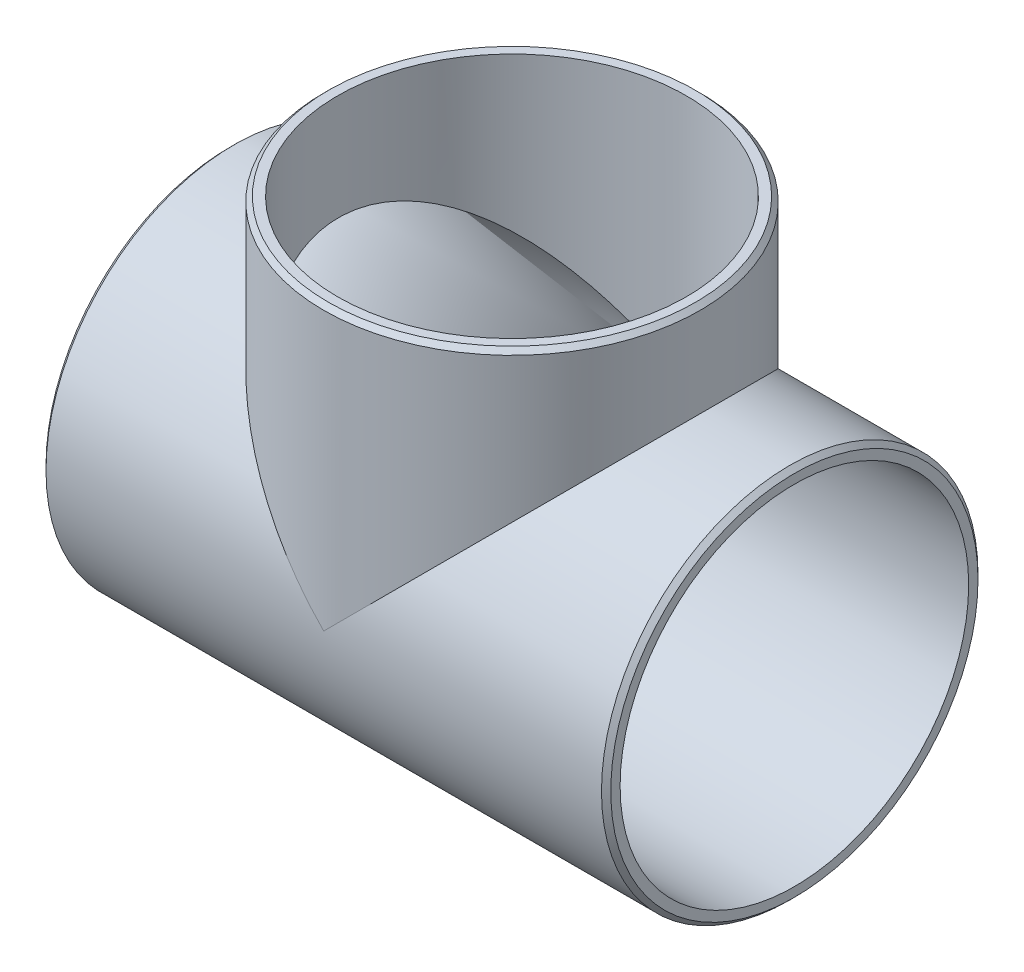
ISO-10303-21;
HEADER;
FILE_DESCRIPTION(('STEP AP214'),'2;1');
FILE_NAME('part.step','',(''),(''),'','','');
FILE_SCHEMA(('AUTOMOTIVE_DESIGN { 1 0 10303 214 1 1 1 1 }'));
ENDSEC;
DATA;
#1=APPLICATION_CONTEXT('core data for automotive mechanical design processes');
#2=APPLICATION_PROTOCOL_DEFINITION('international standard','automotive_design',2000,#1);
#3=PRODUCT_CONTEXT('',#1,'mechanical');
#4=PRODUCT('Part','Part','',(#3));
#5=PRODUCT_RELATED_PRODUCT_CATEGORY('part','',(#4));
#6=PRODUCT_DEFINITION_FORMATION('','',#4);
#7=PRODUCT_DEFINITION_CONTEXT('part definition',#1,'design');
#8=PRODUCT_DEFINITION('design','',#6,#7);
#9=PRODUCT_DEFINITION_SHAPE('','',#8);
#10=(LENGTH_UNIT() NAMED_UNIT(*) SI_UNIT(.MILLI.,.METRE.));
#11=(NAMED_UNIT(*) PLANE_ANGLE_UNIT() SI_UNIT($,.RADIAN.));
#12=(NAMED_UNIT(*) SI_UNIT($,.STERADIAN.) SOLID_ANGLE_UNIT());
#13=UNCERTAINTY_MEASURE_WITH_UNIT(LENGTH_MEASURE(1.E-05),#10,'distance_accuracy_value','');
#14=(GEOMETRIC_REPRESENTATION_CONTEXT(3) GLOBAL_UNCERTAINTY_ASSIGNED_CONTEXT((#13)) GLOBAL_UNIT_ASSIGNED_CONTEXT((#10,
#11,#12)) REPRESENTATION_CONTEXT('',''));
#15=CARTESIAN_POINT('',(0.,0.,0.));
#16=DIRECTION('',(0.,0.,1.));
#17=DIRECTION('',(1.,0.,0.));
#18=AXIS2_PLACEMENT_3D('',#15,#16,#17);
#19=CARTESIAN_POINT('',(-304.8,0.,0.));
#20=DIRECTION('',(-1.,0.,0.));
#21=DIRECTION('',(0.,0.,-1.));
#22=AXIS2_PLACEMENT_3D('',#19,#20,#21);
#23=PLANE('',#22);
#24=CARTESIAN_POINT('',(-304.8,0.,0.));
#25=DIRECTION('',(-1.,0.,0.));
#26=DIRECTION('',(0.,0.,1.));
#27=AXIS2_PLACEMENT_3D('',#24,#25,#26);
#28=CIRCLE('',#27,198.1708);
#29=CARTESIAN_POINT('',(-304.8,0.,198.1708));
#30=VERTEX_POINT('',#29);
#31=EDGE_CURVE('E38',#30,#30,#28,.T.);
#32=ORIENTED_EDGE('',*,*,#31,.T.);
#33=EDGE_LOOP('',(#32));
#34=FACE_BOUND('',#33,.T.);
#35=CARTESIAN_POINT('',(-304.8,0.,0.));
#36=DIRECTION('',(-1.,0.,0.));
#37=DIRECTION('',(0.,0.,1.));
#38=AXIS2_PLACEMENT_3D('',#35,#36,#37);
#39=CIRCLE('',#38,188.1124);
#40=CARTESIAN_POINT('',(-304.8,0.,188.1124));
#41=VERTEX_POINT('',#40);
#42=EDGE_CURVE('E65',#41,#41,#39,.F.);
#43=ORIENTED_EDGE('',*,*,#42,.T.);
#44=EDGE_LOOP('',(#43));
#45=FACE_BOUND('',#44,.T.);
#46=ADVANCED_FACE('F30',(#34,#45),#23,.T.);
#47=CARTESIAN_POINT('',(304.8,0.,0.));
#48=DIRECTION('',(-1.,0.,0.));
#49=DIRECTION('',(0.,0.,1.));
#50=AXIS2_PLACEMENT_3D('',#47,#48,#49);
#51=CYLINDRICAL_SURFACE('',#50,203.2);
#52=CARTESIAN_POINT('',(-299.7708,0.,0.));
#53=DIRECTION('',(-1.,0.,0.));
#54=DIRECTION('',(0.,0.,1.));
#55=AXIS2_PLACEMENT_3D('',#52,#53,#54);
#56=CIRCLE('',#55,203.2);
#57=CARTESIAN_POINT('',(-299.7708,0.,203.2));
#58=VERTEX_POINT('',#57);
#59=EDGE_CURVE('E84',#58,#58,#56,.F.);
#60=ORIENTED_EDGE('',*,*,#59,.T.);
#61=EDGE_LOOP('',(#60));
#62=FACE_BOUND('',#61,.T.);
#63=CARTESIAN_POINT('',(299.7708,0.,0.));
#64=DIRECTION('',(1.,0.,0.));
#65=DIRECTION('',(0.,0.,-1.));
#66=AXIS2_PLACEMENT_3D('',#63,#64,#65);
#67=CIRCLE('',#66,203.2);
#68=CARTESIAN_POINT('',(299.7708,0.,-203.2));
#69=VERTEX_POINT('',#68);
#70=EDGE_CURVE('E81',#69,#69,#67,.F.);
#71=ORIENTED_EDGE('',*,*,#70,.T.);
#72=EDGE_LOOP('',(#71));
#73=FACE_BOUND('',#72,.T.);
#74=CARTESIAN_POINT('',(0.,0.,0.));
#75=DIRECTION('',(-0.707106781186547,-0.707106781186547,0.));
#76=DIRECTION('',(-0.707106781186547,0.707106781186547,0.));
#77=AXIS2_PLACEMENT_3D('',#74,#75,#76);
#78=ELLIPSE('',#77,287.368195874213,203.2);
#79=CARTESIAN_POINT('',(0.,0.,-203.2));
#80=VERTEX_POINT('',#79);
#81=CARTESIAN_POINT('',(1.11022302462516E-13,0.,203.2));
#82=VERTEX_POINT('',#81);
#83=EDGE_CURVE('E47',#80,#82,#78,.F.);
#84=ORIENTED_EDGE('',*,*,#83,.F.);
#85=CARTESIAN_POINT('',(0.,0.,0.));
#86=DIRECTION('',(-0.707106781186547,0.707106781186547,0.));
#87=DIRECTION('',(-0.707106781186547,-0.707106781186547,0.));
#88=AXIS2_PLACEMENT_3D('',#85,#86,#87);
#89=ELLIPSE('',#88,287.368195874213,203.2);
#90=EDGE_CURVE('E44',#82,#80,#89,.T.);
#91=ORIENTED_EDGE('',*,*,#90,.F.);
#92=EDGE_LOOP('',(#84,#91));
#93=FACE_BOUND('',#92,.T.);
#94=ADVANCED_FACE('F97',(#62,#73,#93),#51,.T.);
#95=CARTESIAN_POINT('',(304.8,0.,0.));
#96=DIRECTION('',(1.,0.,0.));
#97=DIRECTION('',(0.,0.,-1.));
#98=AXIS2_PLACEMENT_3D('',#95,#96,#97);
#99=PLANE('',#98);
#100=CARTESIAN_POINT('',(304.8,0.,0.));
#101=DIRECTION('',(1.,0.,0.));
#102=DIRECTION('',(0.,0.,-1.));
#103=AXIS2_PLACEMENT_3D('',#100,#101,#102);
#104=CIRCLE('',#103,198.1708);
#105=CARTESIAN_POINT('',(304.8,0.,-198.1708));
#106=VERTEX_POINT('',#105);
#107=EDGE_CURVE('E11',#106,#106,#104,.T.);
#108=ORIENTED_EDGE('',*,*,#107,.T.);
#109=EDGE_LOOP('',(#108));
#110=FACE_BOUND('',#109,.T.);
#111=CARTESIAN_POINT('',(304.8,0.,0.));
#112=DIRECTION('',(1.,0.,0.));
#113=DIRECTION('',(0.,0.,-1.));
#114=AXIS2_PLACEMENT_3D('',#111,#112,#113);
#115=CIRCLE('',#114,188.1124);
#116=CARTESIAN_POINT('',(304.8,0.,-188.1124));
#117=VERTEX_POINT('',#116);
#118=EDGE_CURVE('E62',#117,#117,#115,.T.);
#119=ORIENTED_EDGE('',*,*,#118,.F.);
#120=EDGE_LOOP('',(#119));
#121=FACE_BOUND('',#120,.T.);
#122=ADVANCED_FACE('F100',(#110,#121),#99,.T.);
#123=CARTESIAN_POINT('',(0.,304.8,0.));
#124=DIRECTION('',(0.,-1.,0.));
#125=DIRECTION('',(0.,0.,-1.));
#126=AXIS2_PLACEMENT_3D('',#123,#124,#125);
#127=CYLINDRICAL_SURFACE('',#126,203.2);
#128=CARTESIAN_POINT('',(0.,299.7708,0.));
#129=DIRECTION('',(0.,1.,0.));
#130=DIRECTION('',(0.,0.,1.));
#131=AXIS2_PLACEMENT_3D('',#128,#129,#130);
#132=CIRCLE('',#131,203.2);
#133=CARTESIAN_POINT('',(0.,299.7708,203.2));
#134=VERTEX_POINT('',#133);
#135=EDGE_CURVE('E78',#134,#134,#132,.F.);
#136=ORIENTED_EDGE('',*,*,#135,.T.);
#137=EDGE_LOOP('',(#136));
#138=FACE_BOUND('',#137,.T.);
#139=ORIENTED_EDGE('',*,*,#90,.T.);
#140=ORIENTED_EDGE('',*,*,#83,.T.);
#141=EDGE_LOOP('',(#139,#140));
#142=FACE_BOUND('',#141,.T.);
#143=ADVANCED_FACE('F110',(#138,#142),#127,.T.);
#144=CARTESIAN_POINT('',(0.,304.8,0.));
#145=DIRECTION('',(0.,1.,0.));
#146=DIRECTION('',(0.,0.,1.));
#147=AXIS2_PLACEMENT_3D('',#144,#145,#146);
#148=PLANE('',#147);
#149=CARTESIAN_POINT('',(0.,304.8,0.));
#150=DIRECTION('',(0.,1.,0.));
#151=DIRECTION('',(0.,0.,1.));
#152=AXIS2_PLACEMENT_3D('',#149,#150,#151);
#153=CIRCLE('',#152,198.1708);
#154=CARTESIAN_POINT('',(0.,304.8,198.1708));
#155=VERTEX_POINT('',#154);
#156=EDGE_CURVE('E75',#155,#155,#153,.T.);
#157=ORIENTED_EDGE('',*,*,#156,.T.);
#158=EDGE_LOOP('',(#157));
#159=FACE_BOUND('',#158,.T.);
#160=CARTESIAN_POINT('',(0.,304.8,0.));
#161=DIRECTION('',(0.,1.,0.));
#162=DIRECTION('',(0.,0.,1.));
#163=AXIS2_PLACEMENT_3D('',#160,#161,#162);
#164=CIRCLE('',#163,188.1124);
#165=CARTESIAN_POINT('',(0.,304.8,188.1124));
#166=VERTEX_POINT('',#165);
#167=EDGE_CURVE('E69',#166,#166,#164,.T.);
#168=ORIENTED_EDGE('',*,*,#167,.F.);
#169=EDGE_LOOP('',(#168));
#170=FACE_BOUND('',#169,.T.);
#171=ADVANCED_FACE('F115',(#159,#170),#148,.T.);
#172=CARTESIAN_POINT('',(304.8,0.,0.));
#173=DIRECTION('',(-1.,0.,0.));
#174=DIRECTION('',(0.,0.,1.));
#175=AXIS2_PLACEMENT_3D('',#172,#173,#174);
#176=CYLINDRICAL_SURFACE('',#175,188.1124);
#177=ORIENTED_EDGE('',*,*,#42,.F.);
#178=EDGE_LOOP('',(#177));
#179=FACE_BOUND('',#178,.T.);
#180=ORIENTED_EDGE('',*,*,#118,.T.);
#181=EDGE_LOOP('',(#180));
#182=FACE_BOUND('',#181,.T.);
#183=CARTESIAN_POINT('',(0.,0.,0.));
#184=DIRECTION('',(-0.707106781186547,-0.707106781186547,0.));
#185=DIRECTION('',(-0.707106781186547,0.707106781186547,0.));
#186=AXIS2_PLACEMENT_3D('',#183,#184,#185);
#187=ELLIPSE('',#186,266.031107330553,188.1124);
#188=CARTESIAN_POINT('',(0.,1.11022302462516E-13,-188.1124));
#189=VERTEX_POINT('',#188);
#190=CARTESIAN_POINT('',(2.22044604925031E-13,0.,188.1124));
#191=VERTEX_POINT('',#190);
#192=EDGE_CURVE('E55',#189,#191,#187,.F.);
#193=ORIENTED_EDGE('',*,*,#192,.T.);
#194=CARTESIAN_POINT('',(0.,0.,0.));
#195=DIRECTION('',(-0.707106781186547,0.707106781186547,0.));
#196=DIRECTION('',(-0.707106781186547,-0.707106781186547,0.));
#197=AXIS2_PLACEMENT_3D('',#194,#195,#196);
#198=ELLIPSE('',#197,266.031107330553,188.1124);
#199=EDGE_CURVE('E58',#191,#189,#198,.T.);
#200=ORIENTED_EDGE('',*,*,#199,.T.);
#201=EDGE_LOOP('',(#193,#200));
#202=FACE_BOUND('',#201,.T.);
#203=ADVANCED_FACE('F61',(#179,#182,#202),#176,.F.);
#204=CARTESIAN_POINT('',(0.,304.8,0.));
#205=DIRECTION('',(0.,-1.,0.));
#206=DIRECTION('',(0.,0.,-1.));
#207=AXIS2_PLACEMENT_3D('',#204,#205,#206);
#208=CYLINDRICAL_SURFACE('',#207,188.1124);
#209=ORIENTED_EDGE('',*,*,#167,.T.);
#210=EDGE_LOOP('',(#209));
#211=FACE_BOUND('',#210,.T.);
#212=ORIENTED_EDGE('',*,*,#199,.F.);
#213=ORIENTED_EDGE('',*,*,#192,.F.);
#214=EDGE_LOOP('',(#212,#213));
#215=FACE_BOUND('',#214,.T.);
#216=ADVANCED_FACE('F57',(#211,#215),#208,.F.);
#217=CARTESIAN_POINT('',(0.,304.8,0.));
#218=DIRECTION('',(0.,-1.,0.));
#219=DIRECTION('',(0.,0.,-1.));
#220=AXIS2_PLACEMENT_3D('',#217,#218,#219);
#221=CONICAL_SURFACE('',#220,198.1708,0.785398163397457);
#222=ORIENTED_EDGE('',*,*,#135,.F.);
#223=EDGE_LOOP('',(#222));
#224=FACE_BOUND('',#223,.T.);
#225=ORIENTED_EDGE('',*,*,#156,.F.);
#226=EDGE_LOOP('',(#225));
#227=FACE_BOUND('',#226,.T.);
#228=ADVANCED_FACE('F94',(#224,#227),#221,.T.);
#229=CARTESIAN_POINT('',(-299.7708,0.,0.));
#230=DIRECTION('',(1.,0.,0.));
#231=DIRECTION('',(0.,0.,-1.));
#232=AXIS2_PLACEMENT_3D('',#229,#230,#231);
#233=CONICAL_SURFACE('',#232,203.2,0.785398163397462);
#234=ORIENTED_EDGE('',*,*,#31,.F.);
#235=EDGE_LOOP('',(#234));
#236=FACE_BOUND('',#235,.T.);
#237=ORIENTED_EDGE('',*,*,#59,.F.);
#238=EDGE_LOOP('',(#237));
#239=FACE_BOUND('',#238,.T.);
#240=ADVANCED_FACE('F91',(#236,#239),#233,.T.);
#241=CARTESIAN_POINT('',(304.8,0.,0.));
#242=DIRECTION('',(-1.,0.,0.));
#243=DIRECTION('',(0.,0.,1.));
#244=AXIS2_PLACEMENT_3D('',#241,#242,#243);
#245=CONICAL_SURFACE('',#244,198.1708,0.785398163397457);
#246=ORIENTED_EDGE('',*,*,#70,.F.);
#247=EDGE_LOOP('',(#246));
#248=FACE_BOUND('',#247,.T.);
#249=ORIENTED_EDGE('',*,*,#107,.F.);
#250=EDGE_LOOP('',(#249));
#251=FACE_BOUND('',#250,.T.);
#252=ADVANCED_FACE('F32',(#248,#251),#245,.T.);
#253=CLOSED_SHELL('',(#46,#94,#122,#143,#171,#203,#216,#228,#240,#252));
#254=MANIFOLD_SOLID_BREP('B2',#253);
#255=ADVANCED_BREP_SHAPE_REPRESENTATION('',(#18,#254),#14);
#256=SHAPE_DEFINITION_REPRESENTATION(#9,#255);
ENDSEC;
END-ISO-10303-21;
